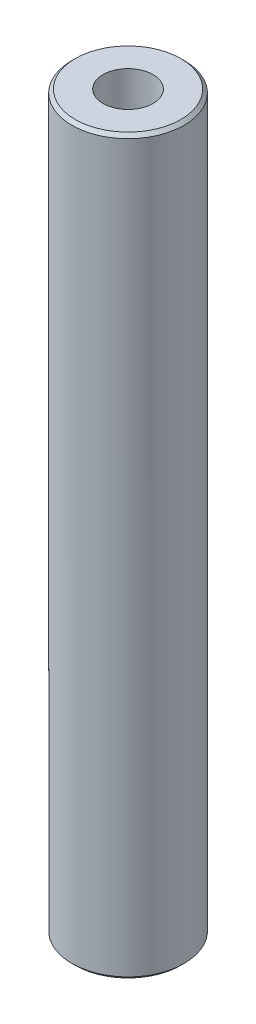
ISO-10303-21;
HEADER;
FILE_DESCRIPTION(('STEP AP214'),'2;1');
FILE_NAME('part.step','',(''),(''),'','','');
FILE_SCHEMA(('AUTOMOTIVE_DESIGN { 1 0 10303 214 1 1 1 1 }'));
ENDSEC;
DATA;
#1=APPLICATION_CONTEXT('core data for automotive mechanical design processes');
#2=APPLICATION_PROTOCOL_DEFINITION('international standard','automotive_design',2000,#1);
#3=PRODUCT_CONTEXT('',#1,'mechanical');
#4=PRODUCT('Part','Part','',(#3));
#5=PRODUCT_RELATED_PRODUCT_CATEGORY('part','',(#4));
#6=PRODUCT_DEFINITION_FORMATION('','',#4);
#7=PRODUCT_DEFINITION_CONTEXT('part definition',#1,'design');
#8=PRODUCT_DEFINITION('design','',#6,#7);
#9=PRODUCT_DEFINITION_SHAPE('','',#8);
#10=(LENGTH_UNIT() NAMED_UNIT(*) SI_UNIT(.MILLI.,.METRE.));
#11=(NAMED_UNIT(*) PLANE_ANGLE_UNIT() SI_UNIT($,.RADIAN.));
#12=(NAMED_UNIT(*) SI_UNIT($,.STERADIAN.) SOLID_ANGLE_UNIT());
#13=UNCERTAINTY_MEASURE_WITH_UNIT(LENGTH_MEASURE(1.E-05),#10,'distance_accuracy_value','');
#14=(GEOMETRIC_REPRESENTATION_CONTEXT(3) GLOBAL_UNCERTAINTY_ASSIGNED_CONTEXT((#13)) GLOBAL_UNIT_ASSIGNED_CONTEXT((#10,
#11,#12)) REPRESENTATION_CONTEXT('',''));
#15=CARTESIAN_POINT('',(0.,0.,0.));
#16=DIRECTION('',(0.,0.,1.));
#17=DIRECTION('',(1.,0.,0.));
#18=AXIS2_PLACEMENT_3D('',#15,#16,#17);
#19=CARTESIAN_POINT('',(0.,163.121718410197,0.));
#20=DIRECTION('',(0.,-1.,0.));
#21=DIRECTION('',(0.,0.,-1.));
#22=AXIS2_PLACEMENT_3D('',#19,#20,#21);
#23=CYLINDRICAL_SURFACE('',#22,12.5);
#24=CARTESIAN_POINT('',(0.,162.37787944925,0.));
#25=DIRECTION('',(0.,1.,0.));
#26=DIRECTION('',(0.,0.,1.));
#27=AXIS2_PLACEMENT_3D('',#24,#25,#26);
#28=CIRCLE('',#27,12.5);
#29=CARTESIAN_POINT('',(0.,162.37787944925,-12.5));
#30=VERTEX_POINT('',#29);
#31=EDGE_CURVE('E50',#30,#30,#28,.F.);
#32=CARTESIAN_POINT('',(0.,0.743838960947762,0.));
#33=DIRECTION('',(0.,1.,0.));
#34=DIRECTION('',(0.,0.,1.));
#35=AXIS2_PLACEMENT_3D('',#32,#33,#34);
#36=CIRCLE('',#35,12.5);
#37=CARTESIAN_POINT('',(0.,0.743838960947762,-12.5));
#38=VERTEX_POINT('',#37);
#39=EDGE_CURVE('E51',#38,#38,#36,.T.);
#40=CARTESIAN_POINT('',(0.,162.37787944925,-12.5));
#41=CARTESIAN_POINT('',(0.,160.694191527497,-12.5));
#42=CARTESIAN_POINT('',(0.,159.010503605744,-12.5));
#43=CARTESIAN_POINT('',(0.,155.643127762237,-12.5));
#44=CARTESIAN_POINT('',(0.,153.959439840484,-12.5));
#45=CARTESIAN_POINT('',(0.,150.592063996978,-12.5));
#46=CARTESIAN_POINT('',(0.,148.908376075225,-12.5));
#47=CARTESIAN_POINT('',(0.,145.541000231718,-12.5));
#48=CARTESIAN_POINT('',(0.,143.857312309965,-12.5));
#49=CARTESIAN_POINT('',(0.,140.489936466459,-12.5));
#50=CARTESIAN_POINT('',(0.,138.806248544706,-12.5));
#51=CARTESIAN_POINT('',(0.,135.4388727012,-12.5));
#52=CARTESIAN_POINT('',(0.,133.755184779446,-12.5));
#53=CARTESIAN_POINT('',(0.,130.38780893594,-12.5));
#54=CARTESIAN_POINT('',(0.,128.704121014187,-12.5));
#55=CARTESIAN_POINT('',(0.,125.336745170681,-12.5));
#56=CARTESIAN_POINT('',(0.,123.653057248928,-12.5));
#57=CARTESIAN_POINT('',(0.,120.285681405421,-12.5));
#58=CARTESIAN_POINT('',(0.,118.601993483668,-12.5));
#59=CARTESIAN_POINT('',(0.,115.234617640162,-12.5));
#60=CARTESIAN_POINT('',(0.,113.550929718409,-12.5));
#61=CARTESIAN_POINT('',(0.,110.183553874902,-12.5));
#62=CARTESIAN_POINT('',(0.,108.499865953149,-12.5));
#63=CARTESIAN_POINT('',(0.,105.132490109643,-12.5));
#64=CARTESIAN_POINT('',(0.,103.44880218789,-12.5));
#65=CARTESIAN_POINT('',(0.,100.081426344383,-12.5));
#66=CARTESIAN_POINT('',(0.,98.3977384226303,-12.5));
#67=CARTESIAN_POINT('',(0.,95.030362579124,-12.5));
#68=CARTESIAN_POINT('',(0.,93.3466746573709,-12.5));
#69=CARTESIAN_POINT('',(0.,89.9792988138646,-12.5));
#70=CARTESIAN_POINT('',(0.,88.2956108921114,-12.5));
#71=CARTESIAN_POINT('',(0.,84.9282350486051,-12.5));
#72=CARTESIAN_POINT('',(0.,83.244547126852,-12.5));
#73=CARTESIAN_POINT('',(0.,79.8771712833457,-12.5));
#74=CARTESIAN_POINT('',(0.,78.1934833615925,-12.5));
#75=CARTESIAN_POINT('',(0.,74.8261075180862,-12.5));
#76=CARTESIAN_POINT('',(0.,73.1424195963331,-12.5));
#77=CARTESIAN_POINT('',(0.,69.7750437528268,-12.5));
#78=CARTESIAN_POINT('',(0.,68.0913558310737,-12.5));
#79=CARTESIAN_POINT('',(0.,64.7239799875674,-12.5));
#80=CARTESIAN_POINT('',(0.,63.0402920658142,-12.5));
#81=CARTESIAN_POINT('',(0.,59.6729162223079,-12.5));
#82=CARTESIAN_POINT('',(0.,57.9892283005548,-12.5));
#83=CARTESIAN_POINT('',(0.,54.6218524570485,-12.5));
#84=CARTESIAN_POINT('',(0.,52.9381645352953,-12.5));
#85=CARTESIAN_POINT('',(0.,49.570788691789,-12.5));
#86=CARTESIAN_POINT('',(0.,47.8871007700359,-12.5));
#87=CARTESIAN_POINT('',(0.,44.5197249265296,-12.5));
#88=CARTESIAN_POINT('',(0.,42.8360370047764,-12.5));
#89=CARTESIAN_POINT('',(0.,39.4686611612701,-12.5));
#90=CARTESIAN_POINT('',(0.,37.784973239517,-12.5));
#91=CARTESIAN_POINT('',(0.,34.4175973960107,-12.5));
#92=CARTESIAN_POINT('',(0.,32.7339094742576,-12.5));
#93=CARTESIAN_POINT('',(0.,29.3665336307513,-12.5));
#94=CARTESIAN_POINT('',(0.,27.6828457089981,-12.5));
#95=CARTESIAN_POINT('',(0.,24.3154698654918,-12.5));
#96=CARTESIAN_POINT('',(0.,22.6317819437387,-12.5));
#97=CARTESIAN_POINT('',(0.,19.2644061002324,-12.5));
#98=CARTESIAN_POINT('',(0.,17.5807181784792,-12.5));
#99=CARTESIAN_POINT('',(0.,14.2133423349729,-12.5));
#100=CARTESIAN_POINT('',(0.,12.5296544132198,-12.5));
#101=CARTESIAN_POINT('',(0.,9.16227856971349,-12.5));
#102=CARTESIAN_POINT('',(0.,7.47859064796034,-12.5));
#103=CARTESIAN_POINT('',(0.,4.11121480445405,-12.5));
#104=CARTESIAN_POINT('',(0.,2.42752688270091,-12.5));
#105=CARTESIAN_POINT('',(0.,0.743838960947762,-12.5));
#106=B_SPLINE_CURVE_WITH_KNOTS('',3,(#40,#41,#42,#43,#44,#45,#46,#47,#48,#49,#50,#51,#52,#53,
#54,#55,#56,#57,#58,#59,#60,#61,#62,#63,#64,#65,#66,#67,#68,#69,#70,#71,#72,#73,#74,#75,#76,#77,
#78,#79,#80,#81,#82,#83,#84,#85,#86,#87,#88,#89,#90,#91,#92,#93,#94,#95,#96,#97,#98,#99,#100,
#101,#102,#103,#104,#105),.UNSPECIFIED.,.F.,.F.,(4,2,2,2,2,2,2,2,2,2,2,2,2,2,2,2,2,2,2,2,2,2,2,
2,2,2,2,2,2,2,2,2,4),(0.,5.05106376525946,10.1021275305189,15.1531912957783,20.2042550610378,
25.2553188262972,30.3063825915567,35.3574463568161,40.4085101220756,45.459573887335,
50.5106376525944,55.5617014178539,60.6127651831133,65.6638289483728,70.7148927136322,
75.7659564788917,80.8170202441511,85.8680840094106,90.91914777467,95.9702115399294,
101.021275305189,106.072339070448,111.123402835708,116.174466600967,121.225530366227,
126.276594131486,131.327657896746,136.378721662005,141.429785427264,146.480849192524,
151.531912957783,156.582976723043,161.634040488302),.UNSPECIFIED.);
#107=EDGE_CURVE('BSEAM39',#30,#38,#106,.T.);
#108=ORIENTED_EDGE('',*,*,#31,.T.);
#109=ORIENTED_EDGE('',*,*,#39,.T.);
#110=ORIENTED_EDGE('',*,*,#107,.T.);
#111=ORIENTED_EDGE('',*,*,#107,.F.);
#112=EDGE_LOOP('',(#108,#110,#109,#111));
#113=FACE_BOUND('',#112,.T.);
#114=ADVANCED_FACE('F39',(#113),#23,.T.);
#115=CARTESIAN_POINT('',(0.,163.121718410197,0.));
#116=DIRECTION('',(0.,1.,0.));
#117=DIRECTION('',(0.,0.,1.));
#118=AXIS2_PLACEMENT_3D('',#115,#116,#117);
#119=PLANE('',#118);
#120=CARTESIAN_POINT('',(0.,163.121718410197,0.));
#121=DIRECTION('',(0.,1.,0.));
#122=DIRECTION('',(0.,0.,1.));
#123=AXIS2_PLACEMENT_3D('',#120,#121,#122);
#124=CIRCLE('',#123,11.7561610390525);
#125=CARTESIAN_POINT('',(0.,163.121718410197,11.7561610390525));
#126=VERTEX_POINT('',#125);
#127=EDGE_CURVE('E54',#126,#126,#124,.T.);
#128=ORIENTED_EDGE('',*,*,#127,.T.);
#129=EDGE_LOOP('',(#128));
#130=FACE_BOUND('',#129,.T.);
#131=CARTESIAN_POINT('',(0.,163.121718410197,0.));
#132=DIRECTION('',(0.,1.,0.));
#133=DIRECTION('',(0.,0.,1.));
#134=AXIS2_PLACEMENT_3D('',#131,#132,#133);
#135=CIRCLE('',#134,5.5744038721354);
#136=CARTESIAN_POINT('',(0.,163.121718410197,-5.5744038721354));
#137=VERTEX_POINT('',#136);
#138=EDGE_CURVE('E58',#137,#137,#135,.T.);
#139=ORIENTED_EDGE('',*,*,#138,.F.);
#140=EDGE_LOOP('',(#139));
#141=FACE_BOUND('',#140,.T.);
#142=ADVANCED_FACE('F69',(#130,#141),#119,.T.);
#143=CARTESIAN_POINT('',(0.,0.,0.));
#144=DIRECTION('',(0.,1.,0.));
#145=DIRECTION('',(0.,0.,1.));
#146=AXIS2_PLACEMENT_3D('',#143,#144,#145);
#147=PLANE('',#146);
#148=CARTESIAN_POINT('',(0.,0.,0.));
#149=DIRECTION('',(0.,1.,0.));
#150=DIRECTION('',(0.,0.,1.));
#151=AXIS2_PLACEMENT_3D('',#148,#149,#150);
#152=CIRCLE('',#151,11.7561610390523);
#153=CARTESIAN_POINT('',(0.,0.,11.7561610390523));
#154=VERTEX_POINT('',#153);
#155=EDGE_CURVE('E10',#154,#154,#152,.F.);
#156=ORIENTED_EDGE('',*,*,#155,.T.);
#157=EDGE_LOOP('',(#156));
#158=FACE_BOUND('',#157,.T.);
#159=CARTESIAN_POINT('',(0.,0.,0.));
#160=DIRECTION('',(0.,1.,0.));
#161=DIRECTION('',(0.,0.,1.));
#162=AXIS2_PLACEMENT_3D('',#159,#160,#161);
#163=CIRCLE('',#162,5.5744038721354);
#164=CARTESIAN_POINT('',(0.,0.,-5.5744038721354));
#165=VERTEX_POINT('',#164);
#166=EDGE_CURVE('E63',#165,#165,#163,.T.);
#167=ORIENTED_EDGE('',*,*,#166,.T.);
#168=EDGE_LOOP('',(#167));
#169=FACE_BOUND('',#168,.T.);
#170=ADVANCED_FACE('F75',(#158,#169),#147,.F.);
#171=CARTESIAN_POINT('',(0.,163.121718410197,0.));
#172=DIRECTION('',(0.,-1.,0.));
#173=DIRECTION('',(0.,0.,-1.));
#174=AXIS2_PLACEMENT_3D('',#171,#172,#173);
#175=CYLINDRICAL_SURFACE('',#174,5.5744038721354);
#176=CARTESIAN_POINT('',(0.,163.121718410197,-5.5744038721354));
#177=CARTESIAN_POINT('',(0.,161.422533843425,-5.5744038721354));
#178=CARTESIAN_POINT('',(0.,159.723349276652,-5.5744038721354));
#179=CARTESIAN_POINT('',(0.,156.324980143106,-5.5744038721354));
#180=CARTESIAN_POINT('',(0.,154.625795576333,-5.5744038721354));
#181=CARTESIAN_POINT('',(0.,151.227426442787,-5.5744038721354));
#182=CARTESIAN_POINT('',(0.,149.528241876014,-5.5744038721354));
#183=CARTESIAN_POINT('',(0.,146.129872742469,-5.5744038721354));
#184=CARTESIAN_POINT('',(0.,144.430688175696,-5.5744038721354));
#185=CARTESIAN_POINT('',(0.,141.03231904215,-5.5744038721354));
#186=CARTESIAN_POINT('',(0.,139.333134475377,-5.5744038721354));
#187=CARTESIAN_POINT('',(0.,135.934765341831,-5.5744038721354));
#188=CARTESIAN_POINT('',(0.,134.235580775058,-5.5744038721354));
#189=CARTESIAN_POINT('',(0.,130.837211641513,-5.5744038721354));
#190=CARTESIAN_POINT('',(0.,129.13802707474,-5.5744038721354));
#191=CARTESIAN_POINT('',(0.,125.739657941194,-5.5744038721354));
#192=CARTESIAN_POINT('',(0.,124.040473374421,-5.5744038721354));
#193=CARTESIAN_POINT('',(0.,120.642104240875,-5.5744038721354));
#194=CARTESIAN_POINT('',(0.,118.942919674102,-5.5744038721354));
#195=CARTESIAN_POINT('',(0.,115.544550540557,-5.5744038721354));
#196=CARTESIAN_POINT('',(0.,113.845365973784,-5.5744038721354));
#197=CARTESIAN_POINT('',(0.,110.446996840238,-5.5744038721354));
#198=CARTESIAN_POINT('',(0.,108.747812273465,-5.5744038721354));
#199=CARTESIAN_POINT('',(0.,105.349443139919,-5.5744038721354));
#200=CARTESIAN_POINT('',(0.,103.650258573146,-5.5744038721354));
#201=CARTESIAN_POINT('',(0.,100.251889439601,-5.5744038721354));
#202=CARTESIAN_POINT('',(0.,98.5527048728276,-5.5744038721354));
#203=CARTESIAN_POINT('',(0.,95.1543357392818,-5.5744038721354));
#204=CARTESIAN_POINT('',(0.,93.455151172509,-5.5744038721354));
#205=CARTESIAN_POINT('',(0.,90.0567820389632,-5.5744038721354));
#206=CARTESIAN_POINT('',(0.,88.3575974721903,-5.5744038721354));
#207=CARTESIAN_POINT('',(0.,84.9592283386445,-5.5744038721354));
#208=CARTESIAN_POINT('',(0.,83.2600437718716,-5.5744038721354));
#209=CARTESIAN_POINT('',(0.,79.8616746383258,-5.5744038721354));
#210=CARTESIAN_POINT('',(0.,78.162490071553,-5.5744038721354));
#211=CARTESIAN_POINT('',(0.,74.7641209380072,-5.5744038721354));
#212=CARTESIAN_POINT('',(0.,73.0649363712343,-5.5744038721354));
#213=CARTESIAN_POINT('',(0.,69.6665672376885,-5.5744038721354));
#214=CARTESIAN_POINT('',(0.,67.9673826709156,-5.5744038721354));
#215=CARTESIAN_POINT('',(0.,64.5690135373698,-5.5744038721354));
#216=CARTESIAN_POINT('',(0.,62.8698289705969,-5.5744038721354));
#217=CARTESIAN_POINT('',(0.,59.4714598370511,-5.5744038721354));
#218=CARTESIAN_POINT('',(0.,57.7722752702783,-5.5744038721354));
#219=CARTESIAN_POINT('',(0.,54.3739061367325,-5.5744038721354));
#220=CARTESIAN_POINT('',(0.,52.6747215699596,-5.5744038721354));
#221=CARTESIAN_POINT('',(0.,49.2763524364138,-5.5744038721354));
#222=CARTESIAN_POINT('',(0.,47.5771678696409,-5.5744038721354));
#223=CARTESIAN_POINT('',(0.,44.1787987360951,-5.5744038721354));
#224=CARTESIAN_POINT('',(0.,42.4796141693222,-5.5744038721354));
#225=CARTESIAN_POINT('',(0.,39.0812450357765,-5.5744038721354));
#226=CARTESIAN_POINT('',(0.,37.3820604690036,-5.5744038721354));
#227=CARTESIAN_POINT('',(0.,33.9836913354578,-5.5744038721354));
#228=CARTESIAN_POINT('',(0.,32.2845067686849,-5.5744038721354));
#229=CARTESIAN_POINT('',(0.,28.8861376351392,-5.5744038721354));
#230=CARTESIAN_POINT('',(0.,27.1869530683663,-5.5744038721354));
#231=CARTESIAN_POINT('',(0.,23.7885839348205,-5.5744038721354));
#232=CARTESIAN_POINT('',(0.,22.0893993680476,-5.5744038721354));
#233=CARTESIAN_POINT('',(0.,18.6910302345018,-5.5744038721354));
#234=CARTESIAN_POINT('',(0.,16.9918456677289,-5.5744038721354));
#235=CARTESIAN_POINT('',(0.,13.5934765341831,-5.5744038721354));
#236=CARTESIAN_POINT('',(0.,11.8942919674102,-5.5744038721354));
#237=CARTESIAN_POINT('',(0.,8.49592283386445,-5.5744038721354));
#238=CARTESIAN_POINT('',(0.,6.79673826709156,-5.5744038721354));
#239=CARTESIAN_POINT('',(0.,3.39836913354578,-5.5744038721354));
#240=CARTESIAN_POINT('',(0.,1.69918456677289,-5.5744038721354));
#241=CARTESIAN_POINT('',(0.,0.,-5.5744038721354));
#242=B_SPLINE_CURVE_WITH_KNOTS('',3,(#176,#177,#178,#179,#180,#181,#182,#183,#184,#185,#186,
#187,#188,#189,#190,#191,#192,#193,#194,#195,#196,#197,#198,#199,#200,#201,#202,#203,#204,#205,
#206,#207,#208,#209,#210,#211,#212,#213,#214,#215,#216,#217,#218,#219,#220,#221,#222,#223,#224,
#225,#226,#227,#228,#229,#230,#231,#232,#233,#234,#235,#236,#237,#238,#239,#240,#241),
.UNSPECIFIED.,.F.,.F.,(4,2,2,2,2,2,2,2,2,2,2,2,2,2,2,2,2,2,2,2,2,2,2,2,2,2,2,2,2,2,2,2,4),(0.,
5.0975537003187,10.1951074006374,15.292661100956,20.3902148012747,25.4877685015934,
30.585322201912,35.6828759022307,40.7804296025494,45.877983302868,50.9755370031867,
56.0730907035054,61.1706444038241,66.2681981041427,71.3657518044614,76.4633055047801,
81.5608592050988,86.6584129054174,91.7559666057361,96.8535203060548,101.951074006373,
107.048627706692,112.146181407011,117.243735107329,122.341288807648,127.438842507967,
132.536396208285,137.633949908604,142.731503608923,147.829057309241,152.92661100956,
158.024164709879,163.121718410197),.UNSPECIFIED.);
#243=EDGE_CURVE('BSEAM70',#137,#165,#242,.T.);
#244=ORIENTED_EDGE('',*,*,#138,.T.);
#245=ORIENTED_EDGE('',*,*,#166,.F.);
#246=ORIENTED_EDGE('',*,*,#243,.T.);
#247=ORIENTED_EDGE('',*,*,#243,.F.);
#248=EDGE_LOOP('',(#244,#246,#245,#247));
#249=FACE_BOUND('',#248,.T.);
#250=ADVANCED_FACE('F70',(#249),#175,.F.);
#251=CARTESIAN_POINT('',(0.,163.121718410197,0.));
#252=DIRECTION('',(0.,-1.,0.));
#253=DIRECTION('',(0.,0.,-1.));
#254=AXIS2_PLACEMENT_3D('',#251,#252,#253);
#255=CONICAL_SURFACE('',#254,11.7561610390525,0.785398163397433);
#256=ORIENTED_EDGE('',*,*,#31,.F.);
#257=EDGE_LOOP('',(#256));
#258=FACE_BOUND('',#257,.T.);
#259=ORIENTED_EDGE('',*,*,#127,.F.);
#260=EDGE_LOOP('',(#259));
#261=FACE_BOUND('',#260,.T.);
#262=ADVANCED_FACE('F81',(#258,#261),#255,.T.);
#263=CARTESIAN_POINT('',(0.,0.743838960947735,0.));
#264=DIRECTION('',(0.,1.,0.));
#265=DIRECTION('',(0.,0.,1.));
#266=AXIS2_PLACEMENT_3D('',#263,#264,#265);
#267=CONICAL_SURFACE('',#266,12.5,0.785398163397443);
#268=ORIENTED_EDGE('',*,*,#155,.F.);
#269=EDGE_LOOP('',(#268));
#270=FACE_BOUND('',#269,.T.);
#271=ORIENTED_EDGE('',*,*,#39,.F.);
#272=EDGE_LOOP('',(#271));
#273=FACE_BOUND('',#272,.T.);
#274=ADVANCED_FACE('F45',(#270,#273),#267,.T.);
#275=CLOSED_SHELL('',(#114,#142,#170,#250,#262,#274));
#276=MANIFOLD_SOLID_BREP('B2',#275);
#277=ADVANCED_BREP_SHAPE_REPRESENTATION('',(#18,#276),#14);
#278=SHAPE_DEFINITION_REPRESENTATION(#9,#277);
ENDSEC;
END-ISO-10303-21;
